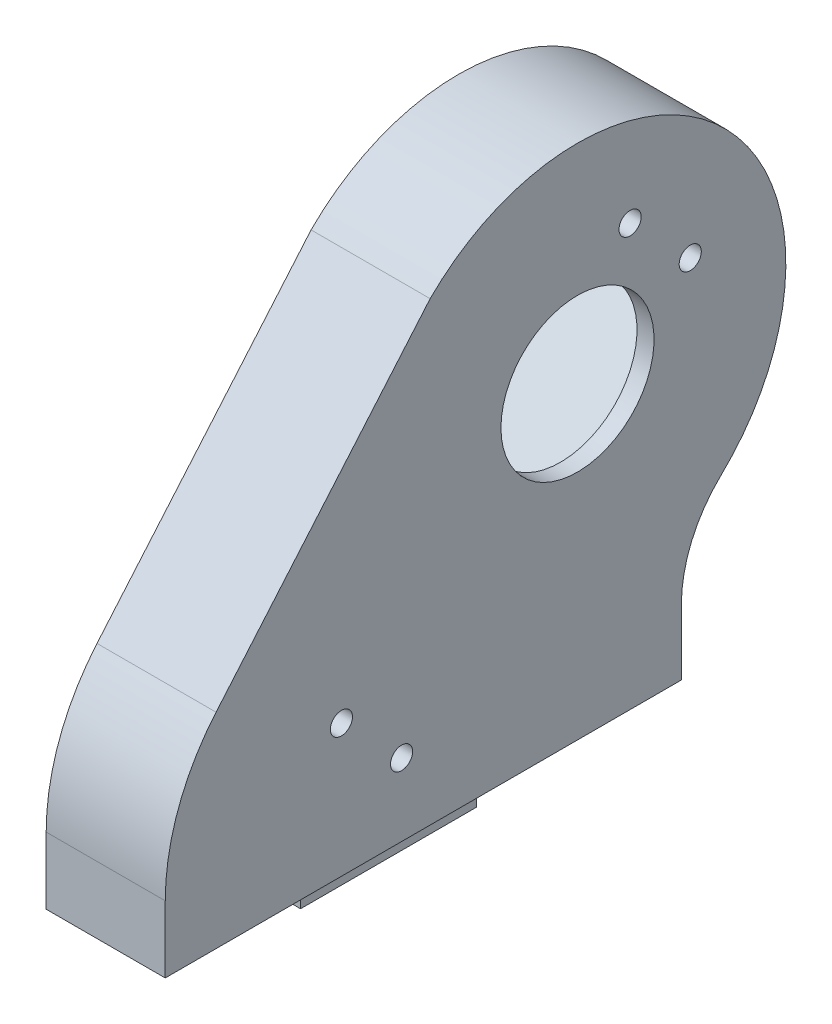
ISO-10303-21;
HEADER;
FILE_DESCRIPTION(('STEP AP214'),'2;1');
FILE_NAME('part.step','',(''),(''),'','','');
FILE_SCHEMA(('AUTOMOTIVE_DESIGN { 1 0 10303 214 1 1 1 1 }'));
ENDSEC;
DATA;
#1=APPLICATION_CONTEXT('core data for automotive mechanical design processes');
#2=APPLICATION_PROTOCOL_DEFINITION('international standard','automotive_design',2000,#1);
#3=PRODUCT_CONTEXT('',#1,'mechanical');
#4=PRODUCT('Part','Part','',(#3));
#5=PRODUCT_RELATED_PRODUCT_CATEGORY('part','',(#4));
#6=PRODUCT_DEFINITION_FORMATION('','',#4);
#7=PRODUCT_DEFINITION_CONTEXT('part definition',#1,'design');
#8=PRODUCT_DEFINITION('design','',#6,#7);
#9=PRODUCT_DEFINITION_SHAPE('','',#8);
#10=(LENGTH_UNIT() NAMED_UNIT(*) SI_UNIT(.MILLI.,.METRE.));
#11=(NAMED_UNIT(*) PLANE_ANGLE_UNIT() SI_UNIT($,.RADIAN.));
#12=(NAMED_UNIT(*) SI_UNIT($,.STERADIAN.) SOLID_ANGLE_UNIT());
#13=UNCERTAINTY_MEASURE_WITH_UNIT(LENGTH_MEASURE(1.E-05),#10,'distance_accuracy_value','');
#14=(GEOMETRIC_REPRESENTATION_CONTEXT(3) GLOBAL_UNCERTAINTY_ASSIGNED_CONTEXT((#13)) GLOBAL_UNIT_ASSIGNED_CONTEXT((#10,
#11,#12)) REPRESENTATION_CONTEXT('',''));
#15=CARTESIAN_POINT('',(0.,0.,0.));
#16=DIRECTION('',(0.,0.,1.));
#17=DIRECTION('',(1.,0.,0.));
#18=AXIS2_PLACEMENT_3D('',#15,#16,#17);
#19=CARTESIAN_POINT('',(1.99999999999999,54.948945885554,-13.741729606692));
#20=DIRECTION('',(0.,0.707106781186547,-0.707106781186548));
#21=DIRECTION('',(0.,0.707106781186548,0.707106781186547));
#22=AXIS2_PLACEMENT_3D('',#19,#20,#21);
#23=PLANE('',#22);
#24=DIRECTION('',(0.,-0.707106781186548,-0.707106781186547));
#25=VECTOR('',#24,1.);
#26=CARTESIAN_POINT('',(-3.5,54.948945885554,-13.741729606692));
#27=LINE('',#26,#25);
#28=CARTESIAN_POINT('',(-3.5,54.948945885554,-13.741729606692));
#29=VERTEX_POINT('',#28);
#30=CARTESIAN_POINT('',(-3.5,40.0997034806365,-28.5909720116095));
#31=VERTEX_POINT('',#30);
#32=EDGE_CURVE('E277',#29,#31,#27,.T.);
#33=ORIENTED_EDGE('',*,*,#32,.T.);
#34=DIRECTION('',(-1.,0.,0.));
#35=VECTOR('',#34,1.);
#36=CARTESIAN_POINT('',(1.99999999999999,40.0997034806365,-28.5909720116095));
#37=LINE('',#36,#35);
#38=CARTESIAN_POINT('',(1.99999999999999,40.0997034806365,-28.5909720116095));
#39=VERTEX_POINT('',#38);
#40=EDGE_CURVE('E389',#39,#31,#37,.T.);
#41=ORIENTED_EDGE('',*,*,#40,.F.);
#42=DIRECTION('',(0.,-0.707106781186548,-0.707106781186547));
#43=VECTOR('',#42,1.);
#44=CARTESIAN_POINT('',(1.99999999999999,54.948945885554,-13.741729606692));
#45=LINE('',#44,#43);
#46=CARTESIAN_POINT('',(1.99999999999999,54.948945885554,-13.741729606692));
#47=VERTEX_POINT('',#46);
#48=EDGE_CURVE('E374',#47,#39,#45,.T.);
#49=ORIENTED_EDGE('',*,*,#48,.F.);
#50=DIRECTION('',(-1.,0.,0.));
#51=VECTOR('',#50,1.);
#52=CARTESIAN_POINT('',(1.99999999999999,54.948945885554,-13.741729606692));
#53=LINE('',#52,#51);
#54=EDGE_CURVE('E392',#47,#29,#53,.T.);
#55=ORIENTED_EDGE('',*,*,#54,.T.);
#56=EDGE_LOOP('',(#33,#41,#49,#55));
#57=FACE_BOUND('',#56,.T.);
#58=ADVANCED_FACE('F58',(#57),#23,.F.);
#59=CARTESIAN_POINT('',(7.99999999999999,4.,0.));
#60=DIRECTION('',(0.,1.,0.));
#61=DIRECTION('',(1.,0.,0.));
#62=AXIS2_PLACEMENT_3D('',#59,#60,#61);
#63=PLANE('',#62);
#64=DIRECTION('',(-1.,0.,0.));
#65=VECTOR('',#64,1.);
#66=CARTESIAN_POINT('',(98.9638448287514,4.,-26.1299478736219));
#67=LINE('',#66,#65);
#68=CARTESIAN_POINT('',(4.,4.,-26.1299478736219));
#69=VERTEX_POINT('',#68);
#70=CARTESIAN_POINT('',(-10.,4.,-26.1299478736219));
#71=VERTEX_POINT('',#70);
#72=EDGE_CURVE('E412',#69,#71,#67,.T.);
#73=ORIENTED_EDGE('',*,*,#72,.F.);
#74=DIRECTION('',(0.,0.,-1.));
#75=VECTOR('',#74,1.);
#76=CARTESIAN_POINT('',(4.,4.,-26.1299478736219));
#77=LINE('',#76,#75);
#78=CARTESIAN_POINT('',(4.,4.,34.549646217337));
#79=VERTEX_POINT('',#78);
#80=EDGE_CURVE('E398',#79,#69,#77,.T.);
#81=ORIENTED_EDGE('',*,*,#80,.F.);
#82=DIRECTION('',(1.,0.,0.));
#83=VECTOR('',#82,1.);
#84=CARTESIAN_POINT('',(-10.,4.,34.5496462173369));
#85=LINE('',#84,#83);
#86=CARTESIAN_POINT('',(-10.,4.,34.549646217337));
#87=VERTEX_POINT('',#86);
#88=EDGE_CURVE('E408',#87,#79,#85,.T.);
#89=ORIENTED_EDGE('',*,*,#88,.F.);
#90=DIRECTION('',(0.,0.,1.));
#91=VECTOR('',#90,1.);
#92=CARTESIAN_POINT('',(-10.,4.,-15.1299478736219));
#93=LINE('',#92,#91);
#94=EDGE_CURVE('E212',#71,#87,#93,.T.);
#95=ORIENTED_EDGE('',*,*,#94,.F.);
#96=EDGE_LOOP('',(#73,#81,#89,#95));
#97=FACE_BOUND('',#96,.T.);
#98=DIRECTION('',(0.,0.,-1.));
#99=VECTOR('',#98,1.);
#100=CARTESIAN_POINT('',(-6.0919121161501,4.,15.549646217337));
#101=LINE('',#100,#99);
#102=CARTESIAN_POINT('',(-6.0919121161501,4.,15.549646217337));
#103=VERTEX_POINT('',#102);
#104=CARTESIAN_POINT('',(-6.0919121161501,4.,-5.15035378266305));
#105=VERTEX_POINT('',#104);
#106=EDGE_CURVE('E330',#103,#105,#101,.T.);
#107=ORIENTED_EDGE('',*,*,#106,.F.);
#108=DIRECTION('',(-1.,0.,0.));
#109=VECTOR('',#108,1.);
#110=CARTESIAN_POINT('',(-6.0919121161501,4.,15.549646217337));
#111=LINE('',#110,#109);
#112=CARTESIAN_POINT('',(0.908087883849897,4.,15.549646217337));
#113=VERTEX_POINT('',#112);
#114=EDGE_CURVE('E335',#113,#103,#111,.T.);
#115=ORIENTED_EDGE('',*,*,#114,.F.);
#116=DIRECTION('',(0.,0.,1.));
#117=VECTOR('',#116,1.);
#118=CARTESIAN_POINT('',(0.908087883849897,4.,15.549646217337));
#119=LINE('',#118,#117);
#120=CARTESIAN_POINT('',(0.908087883849897,4.,-5.15035378266305));
#121=VERTEX_POINT('',#120);
#122=EDGE_CURVE('E349',#121,#113,#119,.T.);
#123=ORIENTED_EDGE('',*,*,#122,.F.);
#124=DIRECTION('',(1.,0.,0.));
#125=VECTOR('',#124,1.);
#126=CARTESIAN_POINT('',(-6.0919121161501,4.,-5.15035378266305));
#127=LINE('',#126,#125);
#128=EDGE_CURVE('E346',#105,#121,#127,.T.);
#129=ORIENTED_EDGE('',*,*,#128,.F.);
#130=EDGE_LOOP('',(#107,#115,#123,#129));
#131=FACE_BOUND('',#130,.T.);
#132=ADVANCED_FACE('F857',(#97,#131),#63,.F.);
#133=CARTESIAN_POINT('',(98.9638448287514,0.,-26.1299478736219));
#134=DIRECTION('',(0.,0.,-1.));
#135=DIRECTION('',(-1.,0.,0.));
#136=AXIS2_PLACEMENT_3D('',#133,#134,#135);
#137=PLANE('',#136);
#138=DIRECTION('',(0.,1.,0.));
#139=VECTOR('',#138,1.);
#140=CARTESIAN_POINT('',(-10.,0.,-26.1299478736219));
#141=LINE('',#140,#139);
#142=CARTESIAN_POINT('',(-10.,11.644549615917,-26.1299478736219));
#143=VERTEX_POINT('',#142);
#144=EDGE_CURVE('E258',#71,#143,#141,.T.);
#145=ORIENTED_EDGE('',*,*,#144,.T.);
#146=DIRECTION('',(1.,0.,0.));
#147=VECTOR('',#146,1.);
#148=CARTESIAN_POINT('',(4.,11.644549615917,-26.1299478736219));
#149=LINE('',#148,#147);
#150=CARTESIAN_POINT('',(4.,11.644549615917,-26.1299478736219));
#151=VERTEX_POINT('',#150);
#152=EDGE_CURVE('E233',#143,#151,#149,.T.);
#153=ORIENTED_EDGE('',*,*,#152,.T.);
#154=DIRECTION('',(0.,1.,0.));
#155=VECTOR('',#154,1.);
#156=CARTESIAN_POINT('',(4.,19.0366427296958,-26.1299478736219));
#157=LINE('',#156,#155);
#158=EDGE_CURVE('E401',#69,#151,#157,.T.);
#159=ORIENTED_EDGE('',*,*,#158,.F.);
#160=ORIENTED_EDGE('',*,*,#72,.T.);
#161=EDGE_LOOP('',(#145,#153,#159,#160));
#162=FACE_BOUND('',#161,.T.);
#163=ADVANCED_FACE('F853',(#162),#137,.T.);
#164=CARTESIAN_POINT('',(98.9638448287514,40.2764801759331,-13.9185063019886));
#165=DIRECTION('',(-1.,0.,0.));
#166=DIRECTION('',(0.,0.,1.));
#167=AXIS2_PLACEMENT_3D('',#164,#165,#166);
#168=CYLINDRICAL_SURFACE('',#167,24.5);
#169=CARTESIAN_POINT('',(-10.,40.2764801759331,-13.9185063019886));
#170=DIRECTION('',(-1.,0.,0.));
#171=DIRECTION('',(0.,0.,1.));
#172=AXIS2_PLACEMENT_3D('',#169,#170,#171);
#173=CIRCLE('',#172,24.5);
#174=CARTESIAN_POINT('',(-10.,22.5174346387079,-30.796489048951));
#175=VERTEX_POINT('',#174);
#176=CARTESIAN_POINT('',(-10.,57.6005963150038,3.40560983708185));
#177=VERTEX_POINT('',#176);
#178=EDGE_CURVE('E250',#175,#177,#173,.F.);
#179=ORIENTED_EDGE('',*,*,#178,.T.);
#180=DIRECTION('',(-1.,0.,0.));
#181=VECTOR('',#180,1.);
#182=CARTESIAN_POINT('',(98.9638448287514,57.6005963150038,3.40560983708185));
#183=LINE('',#182,#181);
#184=CARTESIAN_POINT('',(4.,57.6005963150038,3.40560983708186));
#185=VERTEX_POINT('',#184);
#186=EDGE_CURVE('E236',#185,#177,#183,.T.);
#187=ORIENTED_EDGE('',*,*,#186,.F.);
#188=CARTESIAN_POINT('',(4.,40.2764801759331,-13.9185063019886));
#189=DIRECTION('',(1.,0.,0.));
#190=DIRECTION('',(0.,0.,1.));
#191=AXIS2_PLACEMENT_3D('',#188,#189,#190);
#192=CIRCLE('',#191,24.5000000000001);
#193=CARTESIAN_POINT('',(4.,22.5174346387078,-30.7964890489511));
#194=VERTEX_POINT('',#193);
#195=EDGE_CURVE('E252',#194,#185,#192,.T.);
#196=ORIENTED_EDGE('',*,*,#195,.F.);
#197=DIRECTION('',(-1.,0.,0.));
#198=VECTOR('',#197,1.);
#199=CARTESIAN_POINT('',(98.9638448287514,22.5174346387079,-30.796489048951));
#200=LINE('',#199,#198);
#201=EDGE_CURVE('E223',#194,#175,#200,.T.);
#202=ORIENTED_EDGE('',*,*,#201,.T.);
#203=EDGE_LOOP('',(#179,#187,#196,#202));
#204=FACE_BOUND('',#203,.T.);
#205=ADVANCED_FACE('F248',(#204),#168,.T.);
#206=CARTESIAN_POINT('',(98.9638448287514,25.9248128608695,30.4097431541046));
#207=DIRECTION('',(0.,-0.648759583452649,-0.760993431560579));
#208=DIRECTION('',(0.,-0.760993431560579,0.648759583452649));
#209=AXIS2_PLACEMENT_3D('',#206,#207,#208);
#210=PLANE('',#209);
#211=DIRECTION('',(-1.,0.,0.));
#212=VECTOR('',#211,1.);
#213=CARTESIAN_POINT('',(98.9638448287514,28.0775697746182,28.5744820063514));
#214=LINE('',#213,#212);
#215=CARTESIAN_POINT('',(-10.,28.0775697746182,28.5744820063514));
#216=VERTEX_POINT('',#215);
#217=CARTESIAN_POINT('',(4.,28.0775697746182,28.5744820063514));
#218=VERTEX_POINT('',#217);
#219=EDGE_CURVE('E67',#216,#218,#214,.F.);
#220=ORIENTED_EDGE('',*,*,#219,.T.);
#221=DIRECTION('',(0.,-0.760993431560579,0.648759583452649));
#222=VECTOR('',#221,1.);
#223=CARTESIAN_POINT('',(4.,21.0687165213735,34.549646217337));
#224=LINE('',#223,#222);
#225=EDGE_CURVE('E405',#185,#218,#224,.T.);
#226=ORIENTED_EDGE('',*,*,#225,.F.);
#227=ORIENTED_EDGE('',*,*,#186,.T.);
#228=DIRECTION('',(0.,0.760993431560579,-0.648759583452649));
#229=VECTOR('',#228,1.);
#230=CARTESIAN_POINT('',(-10.,25.9248128608695,30.4097431541046));
#231=LINE('',#230,#229);
#232=EDGE_CURVE('E216',#216,#177,#231,.T.);
#233=ORIENTED_EDGE('',*,*,#232,.F.);
#234=EDGE_LOOP('',(#220,#226,#227,#233));
#235=FACE_BOUND('',#234,.T.);
#236=ADVANCED_FACE('F861',(#235),#210,.F.);
#237=CARTESIAN_POINT('',(-10.,0.,34.5496462173369));
#238=DIRECTION('',(0.,0.,-1.));
#239=DIRECTION('',(-1.,0.,0.));
#240=AXIS2_PLACEMENT_3D('',#237,#238,#239);
#241=PLANE('',#240);
#242=ORIENTED_EDGE('',*,*,#88,.T.);
#243=DIRECTION('',(0.,-1.,0.));
#244=VECTOR('',#243,1.);
#245=CARTESIAN_POINT('',(4.,4.,34.549646217337));
#246=LINE('',#245,#244);
#247=CARTESIAN_POINT('',(4.,11.858580188302,34.549646217337));
#248=VERTEX_POINT('',#247);
#249=EDGE_CURVE('E219',#248,#79,#246,.T.);
#250=ORIENTED_EDGE('',*,*,#249,.F.);
#251=DIRECTION('',(-1.,0.,0.));
#252=VECTOR('',#251,1.);
#253=CARTESIAN_POINT('',(-10.,11.858580188302,34.549646217337));
#254=LINE('',#253,#252);
#255=CARTESIAN_POINT('',(-10.,11.858580188302,34.549646217337));
#256=VERTEX_POINT('',#255);
#257=EDGE_CURVE('E204',#248,#256,#254,.T.);
#258=ORIENTED_EDGE('',*,*,#257,.T.);
#259=DIRECTION('',(0.,1.,0.));
#260=VECTOR('',#259,1.);
#261=CARTESIAN_POINT('',(-10.,0.,34.5496462173369));
#262=LINE('',#261,#260);
#263=EDGE_CURVE('E207',#87,#256,#262,.T.);
#264=ORIENTED_EDGE('',*,*,#263,.F.);
#265=EDGE_LOOP('',(#242,#250,#258,#264));
#266=FACE_BOUND('',#265,.T.);
#267=ADVANCED_FACE('F218',(#266),#241,.F.);
#268=CARTESIAN_POINT('',(4.,40.2764801759331,-13.9185063019886));
#269=DIRECTION('',(-1.,0.,0.));
#270=DIRECTION('',(0.,0.,1.));
#271=AXIS2_PLACEMENT_3D('',#268,#269,#270);
#272=PLANE('',#271);
#273=CARTESIAN_POINT('',(4.,19.5936068262266,13.8354348595834));
#274=DIRECTION('',(1.,0.,0.));
#275=DIRECTION('',(0.,0.,-1.));
#276=AXIS2_PLACEMENT_3D('',#273,#274,#275);
#277=CIRCLE('',#276,1.29999999999999);
#278=CARTESIAN_POINT('',(4.,19.5936068262266,12.5354348595834));
#279=VERTEX_POINT('',#278);
#280=EDGE_CURVE('E267',#279,#279,#277,.T.);
#281=ORIENTED_EDGE('',*,*,#280,.F.);
#282=EDGE_LOOP('',(#281));
#283=FACE_BOUND('',#282,.T.);
#284=CARTESIAN_POINT('',(4.,12.5225390143611,6.76436704771787));
#285=DIRECTION('',(1.,0.,0.));
#286=DIRECTION('',(0.,0.,-1.));
#287=AXIS2_PLACEMENT_3D('',#284,#285,#286);
#288=CIRCLE('',#287,1.29999999999999);
#289=CARTESIAN_POINT('',(4.,12.5225390143611,5.46436704771788));
#290=VERTEX_POINT('',#289);
#291=EDGE_CURVE('E273',#290,#290,#288,.T.);
#292=ORIENTED_EDGE('',*,*,#291,.F.);
#293=EDGE_LOOP('',(#292));
#294=FACE_BOUND('',#293,.T.);
#295=CARTESIAN_POINT('',(4.,53.5347323231809,-20.1056906373709));
#296=DIRECTION('',(1.,0.,0.));
#297=DIRECTION('',(0.,0.,-1.));
#298=AXIS2_PLACEMENT_3D('',#295,#296,#297);
#299=CIRCLE('',#298,1.29999999999999);
#300=CARTESIAN_POINT('',(4.,53.5347323231809,-21.4056906373709));
#301=VERTEX_POINT('',#300);
#302=EDGE_CURVE('E270',#301,#301,#299,.T.);
#303=ORIENTED_EDGE('',*,*,#302,.F.);
#304=EDGE_LOOP('',(#303));
#305=FACE_BOUND('',#304,.T.);
#306=CARTESIAN_POINT('',(4.,46.4636645113155,-27.1767584492364));
#307=DIRECTION('',(1.,0.,0.));
#308=DIRECTION('',(0.,0.,-1.));
#309=AXIS2_PLACEMENT_3D('',#306,#307,#308);
#310=CIRCLE('',#309,1.29999999999999);
#311=CARTESIAN_POINT('',(4.,46.4636645113155,-28.4767584492364));
#312=VERTEX_POINT('',#311);
#313=EDGE_CURVE('E264',#312,#312,#310,.T.);
#314=ORIENTED_EDGE('',*,*,#313,.F.);
#315=EDGE_LOOP('',(#314));
#316=FACE_BOUND('',#315,.T.);
#317=CARTESIAN_POINT('',(4.,40.2764801759331,-13.9185063019886));
#318=DIRECTION('',(-1.,0.,0.));
#319=DIRECTION('',(0.,0.,1.));
#320=AXIS2_PLACEMENT_3D('',#317,#318,#319);
#321=CIRCLE('',#320,8.99999999999999);
#322=CARTESIAN_POINT('',(4.,40.2764801759331,-4.91850630198863));
#323=VERTEX_POINT('',#322);
#324=EDGE_CURVE('E364',#323,#323,#321,.T.);
#325=ORIENTED_EDGE('',*,*,#324,.T.);
#326=EDGE_LOOP('',(#325));
#327=FACE_BOUND('',#326,.T.);
#328=ORIENTED_EDGE('',*,*,#225,.T.);
#329=CARTESIAN_POINT('',(4.,11.858580188302,9.54964621733696));
#330=DIRECTION('',(-1.,0.,0.));
#331=DIRECTION('',(0.,0.,1.));
#332=AXIS2_PLACEMENT_3D('',#329,#330,#331);
#333=CIRCLE('',#332,25.);
#334=EDGE_CURVE('E13',#218,#248,#333,.F.);
#335=ORIENTED_EDGE('',*,*,#334,.T.);
#336=ORIENTED_EDGE('',*,*,#249,.T.);
#337=ORIENTED_EDGE('',*,*,#80,.T.);
#338=ORIENTED_EDGE('',*,*,#158,.T.);
#339=CARTESIAN_POINT('',(4.,11.644549615917,-41.1299478736219));
#340=DIRECTION('',(-1.,0.,0.));
#341=DIRECTION('',(0.,0.,1.));
#342=AXIS2_PLACEMENT_3D('',#339,#340,#341);
#343=CIRCLE('',#342,15.);
#344=EDGE_CURVE('E220',#151,#194,#343,.T.);
#345=ORIENTED_EDGE('',*,*,#344,.T.);
#346=ORIENTED_EDGE('',*,*,#195,.T.);
#347=EDGE_LOOP('',(#328,#335,#336,#337,#338,#345,#346));
#348=FACE_BOUND('',#347,.T.);
#349=ADVANCED_FACE('F868',(#283,#294,#305,#316,#327,#348),#272,.F.);
#350=CARTESIAN_POINT('',(-10.,24.7119793601216,22.6009444067097));
#351=DIRECTION('',(-1.,0.,0.));
#352=DIRECTION('',(0.,0.,1.));
#353=AXIS2_PLACEMENT_3D('',#350,#351,#352);
#354=PLANE('',#353);
#355=DIRECTION('',(0.,0.707106781186548,-0.707106781186548));
#356=VECTOR('',#355,1.);
#357=CARTESIAN_POINT('',(-10.,25.9575678569056,15.2496484219565));
#358=LINE('',#357,#356);
#359=CARTESIAN_POINT('',(-10.,25.9575678569056,15.2496484219565));
#360=VERTEX_POINT('',#359);
#361=CARTESIAN_POINT('',(-10.,59.0360747026256,-17.8288584237636));
#362=VERTEX_POINT('',#361);
#363=EDGE_CURVE('E382',#360,#362,#358,.T.);
#364=ORIENTED_EDGE('',*,*,#363,.F.);
#365=DIRECTION('',(0.,0.707106781186548,0.707106781186547));
#366=VECTOR('',#365,1.);
#367=CARTESIAN_POINT('',(-10.,11.108325451988,0.400406017038955));
#368=LINE('',#367,#366);
#369=CARTESIAN_POINT('',(-10.,11.108325451988,0.400406017038955));
#370=VERTEX_POINT('',#369);
#371=EDGE_CURVE('E367',#370,#360,#368,.T.);
#372=ORIENTED_EDGE('',*,*,#371,.F.);
#373=DIRECTION('',(0.,-0.707106781186547,0.707106781186547));
#374=VECTOR('',#373,1.);
#375=CARTESIAN_POINT('',(-10.,40.0997034806365,-28.5909720116095));
#376=LINE('',#375,#374);
#377=CARTESIAN_POINT('',(-10.,44.1868322977081,-32.6781008286811));
#378=VERTEX_POINT('',#377);
#379=EDGE_CURVE('E372',#378,#370,#376,.T.);
#380=ORIENTED_EDGE('',*,*,#379,.F.);
#381=DIRECTION('',(0.,0.707106781186546,0.707106781186549));
#382=VECTOR('',#381,1.);
#383=CARTESIAN_POINT('',(-10.,59.0360747026256,-17.8288584237636));
#384=LINE('',#383,#382);
#385=EDGE_CURVE('E281',#378,#362,#384,.T.);
#386=ORIENTED_EDGE('',*,*,#385,.T.);
#387=EDGE_LOOP('',(#364,#372,#380,#386));
#388=FACE_BOUND('',#387,.T.);
#389=DIRECTION('',(0.,-0.707106781186547,-0.707106781186547));
#390=VECTOR('',#389,1.);
#391=CARTESIAN_POINT('',(-10.,21.8025485079064,19.2773186975336));
#392=LINE('',#391,#390);
#393=CARTESIAN_POINT('',(-10.,21.8025485079064,19.2773186975336));
#394=VERTEX_POINT('',#393);
#395=CARTESIAN_POINT('',(-10.,6.95330610298891,4.42807629261605));
#396=VERTEX_POINT('',#395);
#397=EDGE_CURVE('E291',#394,#396,#392,.T.);
#398=ORIENTED_EDGE('',*,*,#397,.T.);
#399=DIRECTION('',(0.,0.707106781186547,-0.707106781186547));
#400=VECTOR('',#399,1.);
#401=CARTESIAN_POINT('',(-10.,6.9533061029889,4.42807629261605));
#402=LINE('',#401,#400);
#403=CARTESIAN_POINT('',(-10.,11.0404349200605,0.340947475544445));
#404=VERTEX_POINT('',#403);
#405=EDGE_CURVE('E310',#396,#404,#402,.T.);
#406=ORIENTED_EDGE('',*,*,#405,.T.);
#407=DIRECTION('',(0.,0.707106781186547,0.707106781186547));
#408=VECTOR('',#407,1.);
#409=CARTESIAN_POINT('',(-10.,25.889677324978,15.190189880462));
#410=LINE('',#409,#408);
#411=CARTESIAN_POINT('',(-10.,25.889677324978,15.190189880462));
#412=VERTEX_POINT('',#411);
#413=EDGE_CURVE('E306',#404,#412,#410,.T.);
#414=ORIENTED_EDGE('',*,*,#413,.T.);
#415=DIRECTION('',(0.,-0.707106781186547,0.707106781186547));
#416=VECTOR('',#415,1.);
#417=CARTESIAN_POINT('',(-10.,21.8025485079064,19.2773186975336));
#418=LINE('',#417,#416);
#419=EDGE_CURVE('E303',#412,#394,#418,.T.);
#420=ORIENTED_EDGE('',*,*,#419,.T.);
#421=EDGE_LOOP('',(#398,#406,#414,#420));
#422=FACE_BOUND('',#421,.T.);
#423=ORIENTED_EDGE('',*,*,#263,.T.);
#424=CARTESIAN_POINT('',(-10.,11.858580188302,9.54964621733696));
#425=DIRECTION('',(-1.,0.,0.));
#426=DIRECTION('',(0.,0.,1.));
#427=AXIS2_PLACEMENT_3D('',#424,#425,#426);
#428=CIRCLE('',#427,25.);
#429=EDGE_CURVE('E75',#216,#256,#428,.F.);
#430=ORIENTED_EDGE('',*,*,#429,.F.);
#431=ORIENTED_EDGE('',*,*,#232,.T.);
#432=ORIENTED_EDGE('',*,*,#178,.F.);
#433=CARTESIAN_POINT('',(-10.,11.644549615917,-41.1299478736219));
#434=DIRECTION('',(-1.,0.,0.));
#435=DIRECTION('',(0.,0.,1.));
#436=AXIS2_PLACEMENT_3D('',#433,#434,#435);
#437=CIRCLE('',#436,15.);
#438=EDGE_CURVE('E254',#175,#143,#437,.F.);
#439=ORIENTED_EDGE('',*,*,#438,.T.);
#440=ORIENTED_EDGE('',*,*,#144,.F.);
#441=ORIENTED_EDGE('',*,*,#94,.T.);
#442=EDGE_LOOP('',(#423,#430,#431,#432,#439,#440,#441));
#443=FACE_BOUND('',#442,.T.);
#444=ADVANCED_FACE('F210',(#388,#422,#443),#354,.T.);
#445=CARTESIAN_POINT('',(1.99999999999999,11.108325451988,0.400406017038955));
#446=DIRECTION('',(0.,-0.707106781186547,0.707106781186548));
#447=DIRECTION('',(0.,-0.707106781186548,-0.707106781186547));
#448=AXIS2_PLACEMENT_3D('',#445,#446,#447);
#449=PLANE('',#448);
#450=ORIENTED_EDGE('',*,*,#371,.T.);
#451=DIRECTION('',(-1.,0.,0.));
#452=VECTOR('',#451,1.);
#453=CARTESIAN_POINT('',(1.99999999999999,25.9575678569056,15.2496484219565));
#454=LINE('',#453,#452);
#455=CARTESIAN_POINT('',(1.99999999999999,25.9575678569056,15.2496484219565));
#456=VERTEX_POINT('',#455);
#457=EDGE_CURVE('E379',#456,#360,#454,.T.);
#458=ORIENTED_EDGE('',*,*,#457,.F.);
#459=DIRECTION('',(0.,0.707106781186548,0.707106781186547));
#460=VECTOR('',#459,1.);
#461=CARTESIAN_POINT('',(1.99999999999999,11.108325451988,0.400406017038955));
#462=LINE('',#461,#460);
#463=CARTESIAN_POINT('',(1.99999999999999,11.108325451988,0.400406017038955));
#464=VERTEX_POINT('',#463);
#465=EDGE_CURVE('E368',#464,#456,#462,.T.);
#466=ORIENTED_EDGE('',*,*,#465,.F.);
#467=DIRECTION('',(-1.,0.,0.));
#468=VECTOR('',#467,1.);
#469=CARTESIAN_POINT('',(1.99999999999999,11.108325451988,0.400406017038955));
#470=LINE('',#469,#468);
#471=EDGE_CURVE('E387',#464,#370,#470,.T.);
#472=ORIENTED_EDGE('',*,*,#471,.T.);
#473=EDGE_LOOP('',(#450,#458,#466,#472));
#474=FACE_BOUND('',#473,.T.);
#475=ADVANCED_FACE('F877',(#474),#449,.F.);
#476=CARTESIAN_POINT('',(1.99999999999999,40.0997034806365,-28.5909720116095));
#477=DIRECTION('',(0.,-0.707106781186548,-0.707106781186548));
#478=DIRECTION('',(0.,0.707106781186548,-0.707106781186548));
#479=AXIS2_PLACEMENT_3D('',#476,#477,#478);
#480=PLANE('',#479);
#481=ORIENTED_EDGE('',*,*,#379,.T.);
#482=ORIENTED_EDGE('',*,*,#471,.F.);
#483=DIRECTION('',(0.,-0.707106781186547,0.707106781186547));
#484=VECTOR('',#483,1.);
#485=CARTESIAN_POINT('',(1.99999999999999,40.0997034806365,-28.5909720116095));
#486=LINE('',#485,#484);
#487=EDGE_CURVE('E377',#39,#464,#486,.T.);
#488=ORIENTED_EDGE('',*,*,#487,.F.);
#489=ORIENTED_EDGE('',*,*,#40,.T.);
#490=DIRECTION('',(0.,0.707106781186549,-0.707106781186546));
#491=VECTOR('',#490,1.);
#492=CARTESIAN_POINT('',(-3.5,40.0997034806365,-28.5909720116095));
#493=LINE('',#492,#491);
#494=CARTESIAN_POINT('',(-3.5,44.1868322977081,-32.6781008286811));
#495=VERTEX_POINT('',#494);
#496=EDGE_CURVE('E280',#31,#495,#493,.T.);
#497=ORIENTED_EDGE('',*,*,#496,.T.);
#498=DIRECTION('',(-1.,0.,0.));
#499=VECTOR('',#498,1.);
#500=CARTESIAN_POINT('',(-3.5,44.1868322977081,-32.6781008286811));
#501=LINE('',#500,#499);
#502=EDGE_CURVE('E288',#495,#378,#501,.T.);
#503=ORIENTED_EDGE('',*,*,#502,.T.);
#504=EDGE_LOOP('',(#481,#482,#488,#489,#497,#503));
#505=FACE_BOUND('',#504,.T.);
#506=ADVANCED_FACE('F881',(#505),#480,.F.);
#507=CARTESIAN_POINT('',(1.99999999999999,25.9575678569056,15.2496484219565));
#508=DIRECTION('',(0.,0.707106781186547,0.707106781186548));
#509=DIRECTION('',(0.,-0.707106781186548,0.707106781186547));
#510=AXIS2_PLACEMENT_3D('',#507,#508,#509);
#511=PLANE('',#510);
#512=ORIENTED_EDGE('',*,*,#363,.T.);
#513=DIRECTION('',(-1.,0.,0.));
#514=VECTOR('',#513,1.);
#515=CARTESIAN_POINT('',(-3.5,59.0360747026256,-17.8288584237636));
#516=LINE('',#515,#514);
#517=CARTESIAN_POINT('',(-3.5,59.0360747026256,-17.8288584237636));
#518=VERTEX_POINT('',#517);
#519=EDGE_CURVE('E292',#518,#362,#516,.T.);
#520=ORIENTED_EDGE('',*,*,#519,.F.);
#521=DIRECTION('',(0.,-0.707106781186549,0.707106781186546));
#522=VECTOR('',#521,1.);
#523=CARTESIAN_POINT('',(-3.5,54.948945885554,-13.741729606692));
#524=LINE('',#523,#522);
#525=EDGE_CURVE('E286',#518,#29,#524,.T.);
#526=ORIENTED_EDGE('',*,*,#525,.T.);
#527=ORIENTED_EDGE('',*,*,#54,.F.);
#528=DIRECTION('',(0.,0.707106781186548,-0.707106781186548));
#529=VECTOR('',#528,1.);
#530=CARTESIAN_POINT('',(1.99999999999999,25.9575678569056,15.2496484219565));
#531=LINE('',#530,#529);
#532=EDGE_CURVE('E371',#456,#47,#531,.T.);
#533=ORIENTED_EDGE('',*,*,#532,.F.);
#534=ORIENTED_EDGE('',*,*,#457,.T.);
#535=EDGE_LOOP('',(#512,#520,#526,#527,#533,#534));
#536=FACE_BOUND('',#535,.T.);
#537=ADVANCED_FACE('F883',(#536),#511,.F.);
#538=CARTESIAN_POINT('',(1.99999999999999,0.,0.));
#539=DIRECTION('',(-1.,0.,0.));
#540=DIRECTION('',(0.,0.,1.));
#541=AXIS2_PLACEMENT_3D('',#538,#539,#540);
#542=PLANE('',#541);
#543=CARTESIAN_POINT('',(1.99999999999999,40.2764801759331,-13.9185063019886));
#544=DIRECTION('',(-1.,0.,0.));
#545=DIRECTION('',(0.,0.,1.));
#546=AXIS2_PLACEMENT_3D('',#543,#544,#545);
#547=CIRCLE('',#546,8.99999999999999);
#548=CARTESIAN_POINT('',(1.99999999999999,40.2764801759331,-4.91850630198863));
#549=VERTEX_POINT('',#548);
#550=EDGE_CURVE('E361',#549,#549,#547,.T.);
#551=ORIENTED_EDGE('',*,*,#550,.F.);
#552=EDGE_LOOP('',(#551));
#553=FACE_BOUND('',#552,.T.);
#554=ORIENTED_EDGE('',*,*,#465,.T.);
#555=ORIENTED_EDGE('',*,*,#532,.T.);
#556=ORIENTED_EDGE('',*,*,#48,.T.);
#557=ORIENTED_EDGE('',*,*,#487,.T.);
#558=EDGE_LOOP('',(#554,#555,#556,#557));
#559=FACE_BOUND('',#558,.T.);
#560=ADVANCED_FACE('F886',(#553,#559),#542,.T.);
#561=CARTESIAN_POINT('',(1.99999999999999,40.2764801759331,-13.9185063019886));
#562=DIRECTION('',(-1.,0.,0.));
#563=DIRECTION('',(0.,0.,1.));
#564=AXIS2_PLACEMENT_3D('',#561,#562,#563);
#565=CYLINDRICAL_SURFACE('',#564,8.99999999999999);
#566=ORIENTED_EDGE('',*,*,#550,.T.);
#567=EDGE_LOOP('',(#566));
#568=FACE_BOUND('',#567,.T.);
#569=ORIENTED_EDGE('',*,*,#324,.F.);
#570=EDGE_LOOP('',(#569));
#571=FACE_BOUND('',#570,.T.);
#572=ADVANCED_FACE('F896',(#568,#571),#565,.F.);
#573=CARTESIAN_POINT('',(98.9638448287514,11.644549615917,-41.1299478736219));
#574=DIRECTION('',(-1.,0.,0.));
#575=DIRECTION('',(0.,0.,1.));
#576=AXIS2_PLACEMENT_3D('',#573,#574,#575);
#577=CYLINDRICAL_SURFACE('',#576,15.);
#578=ORIENTED_EDGE('',*,*,#201,.F.);
#579=ORIENTED_EDGE('',*,*,#344,.F.);
#580=ORIENTED_EDGE('',*,*,#152,.F.);
#581=ORIENTED_EDGE('',*,*,#438,.F.);
#582=EDGE_LOOP('',(#578,#579,#580,#581));
#583=FACE_BOUND('',#582,.T.);
#584=ADVANCED_FACE('F512',(#583),#577,.F.);
#585=CARTESIAN_POINT('',(-10.,11.858580188302,9.54964621733696));
#586=DIRECTION('',(-1.,0.,0.));
#587=DIRECTION('',(0.,0.,1.));
#588=AXIS2_PLACEMENT_3D('',#585,#586,#587);
#589=CYLINDRICAL_SURFACE('',#588,25.);
#590=ORIENTED_EDGE('',*,*,#429,.T.);
#591=ORIENTED_EDGE('',*,*,#257,.F.);
#592=ORIENTED_EDGE('',*,*,#334,.F.);
#593=ORIENTED_EDGE('',*,*,#219,.F.);
#594=EDGE_LOOP('',(#590,#591,#592,#593));
#595=FACE_BOUND('',#594,.T.);
#596=ADVANCED_FACE('F60',(#595),#589,.T.);
#597=CARTESIAN_POINT('',(-6.0919121161501,0.,15.549646217337));
#598=DIRECTION('',(1.,0.,0.));
#599=DIRECTION('',(0.,0.,-1.));
#600=AXIS2_PLACEMENT_3D('',#597,#598,#599);
#601=PLANE('',#600);
#602=ORIENTED_EDGE('',*,*,#106,.T.);
#603=DIRECTION('',(0.,1.,0.));
#604=VECTOR('',#603,1.);
#605=CARTESIAN_POINT('',(-6.0919121161501,0.,-5.15035378266305));
#606=LINE('',#605,#604);
#607=CARTESIAN_POINT('',(-6.0919121161501,0.,-5.15035378266305));
#608=VERTEX_POINT('',#607);
#609=EDGE_CURVE('E359',#608,#105,#606,.T.);
#610=ORIENTED_EDGE('',*,*,#609,.F.);
#611=DIRECTION('',(0.,0.,-1.));
#612=VECTOR('',#611,1.);
#613=CARTESIAN_POINT('',(-6.0919121161501,0.,15.549646217337));
#614=LINE('',#613,#612);
#615=CARTESIAN_POINT('',(-6.0919121161501,0.,15.549646217337));
#616=VERTEX_POINT('',#615);
#617=EDGE_CURVE('E331',#616,#608,#614,.T.);
#618=ORIENTED_EDGE('',*,*,#617,.F.);
#619=DIRECTION('',(0.,1.,0.));
#620=VECTOR('',#619,1.);
#621=CARTESIAN_POINT('',(-6.0919121161501,0.,15.549646217337));
#622=LINE('',#621,#620);
#623=EDGE_CURVE('E343',#616,#103,#622,.T.);
#624=ORIENTED_EDGE('',*,*,#623,.T.);
#625=EDGE_LOOP('',(#602,#610,#618,#624));
#626=FACE_BOUND('',#625,.T.);
#627=ADVANCED_FACE('F920',(#626),#601,.F.);
#628=CARTESIAN_POINT('',(-6.0919121161501,0.,-5.15035378266305));
#629=DIRECTION('',(0.,0.,1.));
#630=DIRECTION('',(1.,0.,0.));
#631=AXIS2_PLACEMENT_3D('',#628,#629,#630);
#632=PLANE('',#631);
#633=ORIENTED_EDGE('',*,*,#128,.T.);
#634=DIRECTION('',(0.,1.,0.));
#635=VECTOR('',#634,1.);
#636=CARTESIAN_POINT('',(0.908087883849897,0.,-5.15035378266305));
#637=LINE('',#636,#635);
#638=CARTESIAN_POINT('',(0.908087883849897,0.,-5.15035378266305));
#639=VERTEX_POINT('',#638);
#640=EDGE_CURVE('E357',#639,#121,#637,.T.);
#641=ORIENTED_EDGE('',*,*,#640,.F.);
#642=DIRECTION('',(1.,0.,0.));
#643=VECTOR('',#642,1.);
#644=CARTESIAN_POINT('',(-6.0919121161501,0.,-5.15035378266305));
#645=LINE('',#644,#643);
#646=EDGE_CURVE('E334',#608,#639,#645,.T.);
#647=ORIENTED_EDGE('',*,*,#646,.F.);
#648=ORIENTED_EDGE('',*,*,#609,.T.);
#649=EDGE_LOOP('',(#633,#641,#647,#648));
#650=FACE_BOUND('',#649,.T.);
#651=ADVANCED_FACE('F923',(#650),#632,.F.);
#652=CARTESIAN_POINT('',(0.908087883849897,0.,15.549646217337));
#653=DIRECTION('',(-1.,0.,0.));
#654=DIRECTION('',(0.,0.,1.));
#655=AXIS2_PLACEMENT_3D('',#652,#653,#654);
#656=PLANE('',#655);
#657=ORIENTED_EDGE('',*,*,#122,.T.);
#658=DIRECTION('',(0.,1.,0.));
#659=VECTOR('',#658,1.);
#660=CARTESIAN_POINT('',(0.908087883849897,0.,15.549646217337));
#661=LINE('',#660,#659);
#662=CARTESIAN_POINT('',(0.908087883849897,0.,15.549646217337));
#663=VERTEX_POINT('',#662);
#664=EDGE_CURVE('E355',#663,#113,#661,.T.);
#665=ORIENTED_EDGE('',*,*,#664,.F.);
#666=DIRECTION('',(0.,0.,1.));
#667=VECTOR('',#666,1.);
#668=CARTESIAN_POINT('',(0.908087883849897,0.,15.549646217337));
#669=LINE('',#668,#667);
#670=EDGE_CURVE('E338',#639,#663,#669,.T.);
#671=ORIENTED_EDGE('',*,*,#670,.F.);
#672=ORIENTED_EDGE('',*,*,#640,.T.);
#673=EDGE_LOOP('',(#657,#665,#671,#672));
#674=FACE_BOUND('',#673,.T.);
#675=ADVANCED_FACE('F927',(#674),#656,.F.);
#676=CARTESIAN_POINT('',(-6.0919121161501,0.,15.549646217337));
#677=DIRECTION('',(0.,0.,-1.));
#678=DIRECTION('',(-1.,0.,0.));
#679=AXIS2_PLACEMENT_3D('',#676,#677,#678);
#680=PLANE('',#679);
#681=ORIENTED_EDGE('',*,*,#114,.T.);
#682=ORIENTED_EDGE('',*,*,#623,.F.);
#683=DIRECTION('',(-1.,0.,0.));
#684=VECTOR('',#683,1.);
#685=CARTESIAN_POINT('',(-6.0919121161501,0.,15.549646217337));
#686=LINE('',#685,#684);
#687=EDGE_CURVE('E341',#663,#616,#686,.T.);
#688=ORIENTED_EDGE('',*,*,#687,.F.);
#689=ORIENTED_EDGE('',*,*,#664,.T.);
#690=EDGE_LOOP('',(#681,#682,#688,#689));
#691=FACE_BOUND('',#690,.T.);
#692=ADVANCED_FACE('F931',(#691),#680,.F.);
#693=CARTESIAN_POINT('',(7.99999999999999,0.,0.));
#694=DIRECTION('',(0.,-1.,0.));
#695=DIRECTION('',(0.,0.,-1.));
#696=AXIS2_PLACEMENT_3D('',#693,#694,#695);
#697=PLANE('',#696);
#698=ORIENTED_EDGE('',*,*,#617,.T.);
#699=ORIENTED_EDGE('',*,*,#646,.T.);
#700=ORIENTED_EDGE('',*,*,#670,.T.);
#701=ORIENTED_EDGE('',*,*,#687,.T.);
#702=EDGE_LOOP('',(#698,#699,#700,#701));
#703=FACE_BOUND('',#702,.T.);
#704=ADVANCED_FACE('F935',(#703),#697,.T.);
#705=CARTESIAN_POINT('',(-3.5,0.,0.));
#706=DIRECTION('',(-1.,0.,0.));
#707=DIRECTION('',(0.,0.,-1.));
#708=AXIS2_PLACEMENT_3D('',#705,#706,#707);
#709=PLANE('',#708);
#710=DIRECTION('',(0.,-0.707106781186547,-0.707106781186547));
#711=VECTOR('',#710,1.);
#712=CARTESIAN_POINT('',(-3.5,21.8025485079064,19.2773186975336));
#713=LINE('',#712,#711);
#714=CARTESIAN_POINT('',(-3.5,21.8025485079064,19.2773186975336));
#715=VERTEX_POINT('',#714);
#716=CARTESIAN_POINT('',(-3.5,6.9533061029889,4.42807629261605));
#717=VERTEX_POINT('',#716);
#718=EDGE_CURVE('E307',#715,#717,#713,.T.);
#719=ORIENTED_EDGE('',*,*,#718,.F.);
#720=DIRECTION('',(0.,-0.707106781186547,0.707106781186547));
#721=VECTOR('',#720,1.);
#722=CARTESIAN_POINT('',(-3.5,21.8025485079064,19.2773186975336));
#723=LINE('',#722,#721);
#724=CARTESIAN_POINT('',(-3.5,25.889677324978,15.190189880462));
#725=VERTEX_POINT('',#724);
#726=EDGE_CURVE('E297',#725,#715,#723,.T.);
#727=ORIENTED_EDGE('',*,*,#726,.F.);
#728=DIRECTION('',(0.,0.707106781186547,0.707106781186547));
#729=VECTOR('',#728,1.);
#730=CARTESIAN_POINT('',(-3.5,25.889677324978,15.190189880462));
#731=LINE('',#730,#729);
#732=CARTESIAN_POINT('',(-3.5,11.0404349200605,0.340947475544445));
#733=VERTEX_POINT('',#732);
#734=EDGE_CURVE('E317',#733,#725,#731,.T.);
#735=ORIENTED_EDGE('',*,*,#734,.F.);
#736=DIRECTION('',(0.,0.707106781186547,-0.707106781186547));
#737=VECTOR('',#736,1.);
#738=CARTESIAN_POINT('',(-3.5,6.9533061029889,4.42807629261605));
#739=LINE('',#738,#737);
#740=EDGE_CURVE('E320',#717,#733,#739,.T.);
#741=ORIENTED_EDGE('',*,*,#740,.F.);
#742=EDGE_LOOP('',(#719,#727,#735,#741));
#743=FACE_BOUND('',#742,.T.);
#744=CARTESIAN_POINT('',(-3.5,19.5936068262266,13.8354348595834));
#745=DIRECTION('',(1.,0.,0.));
#746=DIRECTION('',(0.,0.,-1.));
#747=AXIS2_PLACEMENT_3D('',#744,#745,#746);
#748=CIRCLE('',#747,1.29999999999999);
#749=CARTESIAN_POINT('',(-3.5,19.5936068262266,12.5354348595834));
#750=VERTEX_POINT('',#749);
#751=EDGE_CURVE('E294',#750,#750,#748,.F.);
#752=ORIENTED_EDGE('',*,*,#751,.F.);
#753=EDGE_LOOP('',(#752));
#754=FACE_BOUND('',#753,.T.);
#755=CARTESIAN_POINT('',(-3.5,12.5225390143611,6.76436704771787));
#756=DIRECTION('',(1.,0.,0.));
#757=DIRECTION('',(0.,0.,-1.));
#758=AXIS2_PLACEMENT_3D('',#755,#756,#757);
#759=CIRCLE('',#758,1.29999999999999);
#760=CARTESIAN_POINT('',(-3.5,12.5225390143611,5.46436704771788));
#761=VERTEX_POINT('',#760);
#762=EDGE_CURVE('E324',#761,#761,#759,.F.);
#763=ORIENTED_EDGE('',*,*,#762,.F.);
#764=EDGE_LOOP('',(#763));
#765=FACE_BOUND('',#764,.T.);
#766=ADVANCED_FACE('F939',(#743,#754,#765),#709,.T.);
#767=CARTESIAN_POINT('',(-3.5,21.8025485079064,19.2773186975336));
#768=DIRECTION('',(0.,-0.707106781186548,0.707106781186548));
#769=DIRECTION('',(0.,-0.707106781186548,-0.707106781186548));
#770=AXIS2_PLACEMENT_3D('',#767,#768,#769);
#771=PLANE('',#770);
#772=ORIENTED_EDGE('',*,*,#397,.F.);
#773=DIRECTION('',(-1.,0.,0.));
#774=VECTOR('',#773,1.);
#775=CARTESIAN_POINT('',(-3.5,21.8025485079064,19.2773186975336));
#776=LINE('',#775,#774);
#777=EDGE_CURVE('E276',#715,#394,#776,.T.);
#778=ORIENTED_EDGE('',*,*,#777,.F.);
#779=ORIENTED_EDGE('',*,*,#718,.T.);
#780=DIRECTION('',(-1.,0.,0.));
#781=VECTOR('',#780,1.);
#782=CARTESIAN_POINT('',(-3.5,6.9533061029889,4.42807629261605));
#783=LINE('',#782,#781);
#784=EDGE_CURVE('E83',#717,#396,#783,.T.);
#785=ORIENTED_EDGE('',*,*,#784,.T.);
#786=EDGE_LOOP('',(#772,#778,#779,#785));
#787=FACE_BOUND('',#786,.T.);
#788=ADVANCED_FACE('F943',(#787),#771,.F.);
#789=CARTESIAN_POINT('',(-3.5,21.8025485079064,19.2773186975336));
#790=DIRECTION('',(0.,0.707106781186548,0.707106781186548));
#791=DIRECTION('',(0.,-0.707106781186548,0.707106781186548));
#792=AXIS2_PLACEMENT_3D('',#789,#790,#791);
#793=PLANE('',#792);
#794=ORIENTED_EDGE('',*,*,#419,.F.);
#795=DIRECTION('',(-1.,0.,0.));
#796=VECTOR('',#795,1.);
#797=CARTESIAN_POINT('',(-3.5,25.889677324978,15.190189880462));
#798=LINE('',#797,#796);
#799=EDGE_CURVE('E300',#725,#412,#798,.T.);
#800=ORIENTED_EDGE('',*,*,#799,.F.);
#801=ORIENTED_EDGE('',*,*,#726,.T.);
#802=ORIENTED_EDGE('',*,*,#777,.T.);
#803=EDGE_LOOP('',(#794,#800,#801,#802));
#804=FACE_BOUND('',#803,.T.);
#805=ADVANCED_FACE('F945',(#804),#793,.F.);
#806=CARTESIAN_POINT('',(-3.5,25.889677324978,15.190189880462));
#807=DIRECTION('',(0.,0.707106781186548,-0.707106781186548));
#808=DIRECTION('',(0.,0.707106781186548,0.707106781186548));
#809=AXIS2_PLACEMENT_3D('',#806,#807,#808);
#810=PLANE('',#809);
#811=ORIENTED_EDGE('',*,*,#413,.F.);
#812=DIRECTION('',(-1.,0.,0.));
#813=VECTOR('',#812,1.);
#814=CARTESIAN_POINT('',(-3.5,11.0404349200605,0.340947475544445));
#815=LINE('',#814,#813);
#816=EDGE_CURVE('E298',#733,#404,#815,.T.);
#817=ORIENTED_EDGE('',*,*,#816,.F.);
#818=ORIENTED_EDGE('',*,*,#734,.T.);
#819=ORIENTED_EDGE('',*,*,#799,.T.);
#820=EDGE_LOOP('',(#811,#817,#818,#819));
#821=FACE_BOUND('',#820,.T.);
#822=ADVANCED_FACE('F948',(#821),#810,.F.);
#823=CARTESIAN_POINT('',(-3.5,6.9533061029889,4.42807629261605));
#824=DIRECTION('',(0.,-0.707106781186548,-0.707106781186548));
#825=DIRECTION('',(0.,0.707106781186548,-0.707106781186548));
#826=AXIS2_PLACEMENT_3D('',#823,#824,#825);
#827=PLANE('',#826);
#828=ORIENTED_EDGE('',*,*,#405,.F.);
#829=ORIENTED_EDGE('',*,*,#784,.F.);
#830=ORIENTED_EDGE('',*,*,#740,.T.);
#831=ORIENTED_EDGE('',*,*,#816,.T.);
#832=EDGE_LOOP('',(#828,#829,#830,#831));
#833=FACE_BOUND('',#832,.T.);
#834=ADVANCED_FACE('F915',(#833),#827,.F.);
#835=CARTESIAN_POINT('',(-10.,12.5225390143611,6.76436704771787));
#836=DIRECTION('',(-1.,0.,0.));
#837=DIRECTION('',(0.,0.,1.));
#838=AXIS2_PLACEMENT_3D('',#835,#836,#837);
#839=CYLINDRICAL_SURFACE('',#838,1.29999999999999);
#840=ORIENTED_EDGE('',*,*,#762,.T.);
#841=EDGE_LOOP('',(#840));
#842=FACE_BOUND('',#841,.T.);
#843=ORIENTED_EDGE('',*,*,#291,.T.);
#844=EDGE_LOOP('',(#843));
#845=FACE_BOUND('',#844,.T.);
#846=ADVANCED_FACE('F911',(#842,#845),#839,.F.);
#847=CARTESIAN_POINT('',(-3.5,0.,0.));
#848=DIRECTION('',(-1.,0.,0.));
#849=DIRECTION('',(0.,0.,-1.));
#850=AXIS2_PLACEMENT_3D('',#847,#848,#849);
#851=PLANE('',#850);
#852=ORIENTED_EDGE('',*,*,#32,.F.);
#853=ORIENTED_EDGE('',*,*,#525,.F.);
#854=DIRECTION('',(0.,0.707106781186546,0.707106781186549));
#855=VECTOR('',#854,1.);
#856=CARTESIAN_POINT('',(-3.5,59.0360747026256,-17.8288584237636));
#857=LINE('',#856,#855);
#858=EDGE_CURVE('E284',#495,#518,#857,.T.);
#859=ORIENTED_EDGE('',*,*,#858,.F.);
#860=ORIENTED_EDGE('',*,*,#496,.F.);
#861=EDGE_LOOP('',(#852,#853,#859,#860));
#862=FACE_BOUND('',#861,.T.);
#863=CARTESIAN_POINT('',(-3.5,46.4636645113155,-27.1767584492364));
#864=DIRECTION('',(1.,0.,0.));
#865=DIRECTION('',(0.,0.,-1.));
#866=AXIS2_PLACEMENT_3D('',#863,#864,#865);
#867=CIRCLE('',#866,1.29999999999999);
#868=CARTESIAN_POINT('',(-3.5,46.4636645113155,-28.4767584492364));
#869=VERTEX_POINT('',#868);
#870=EDGE_CURVE('E232',#869,#869,#867,.F.);
#871=ORIENTED_EDGE('',*,*,#870,.F.);
#872=EDGE_LOOP('',(#871));
#873=FACE_BOUND('',#872,.T.);
#874=CARTESIAN_POINT('',(-3.5,53.5347323231809,-20.1056906373709));
#875=DIRECTION('',(1.,0.,0.));
#876=DIRECTION('',(0.,0.,-1.));
#877=AXIS2_PLACEMENT_3D('',#874,#875,#876);
#878=CIRCLE('',#877,1.29999999999999);
#879=CARTESIAN_POINT('',(-3.5,53.5347323231809,-21.4056906373709));
#880=VERTEX_POINT('',#879);
#881=EDGE_CURVE('E327',#880,#880,#878,.F.);
#882=ORIENTED_EDGE('',*,*,#881,.F.);
#883=EDGE_LOOP('',(#882));
#884=FACE_BOUND('',#883,.T.);
#885=ADVANCED_FACE('F914',(#862,#873,#884),#851,.T.);
#886=CARTESIAN_POINT('',(-3.5,59.0360747026256,-17.8288584237636));
#887=DIRECTION('',(0.,0.707106781186549,-0.707106781186546));
#888=DIRECTION('',(0.,0.707106781186546,0.707106781186549));
#889=AXIS2_PLACEMENT_3D('',#886,#887,#888);
#890=PLANE('',#889);
#891=ORIENTED_EDGE('',*,*,#385,.F.);
#892=ORIENTED_EDGE('',*,*,#502,.F.);
#893=ORIENTED_EDGE('',*,*,#858,.T.);
#894=ORIENTED_EDGE('',*,*,#519,.T.);
#895=EDGE_LOOP('',(#891,#892,#893,#894));
#896=FACE_BOUND('',#895,.T.);
#897=ADVANCED_FACE('F905',(#896),#890,.F.);
#898=CARTESIAN_POINT('',(-10.,53.5347323231809,-20.1056906373709));
#899=DIRECTION('',(-1.,0.,0.));
#900=DIRECTION('',(0.,0.,1.));
#901=AXIS2_PLACEMENT_3D('',#898,#899,#900);
#902=CYLINDRICAL_SURFACE('',#901,1.29999999999999);
#903=ORIENTED_EDGE('',*,*,#881,.T.);
#904=EDGE_LOOP('',(#903));
#905=FACE_BOUND('',#904,.T.);
#906=ORIENTED_EDGE('',*,*,#302,.T.);
#907=EDGE_LOOP('',(#906));
#908=FACE_BOUND('',#907,.T.);
#909=ADVANCED_FACE('F901',(#905,#908),#902,.F.);
#910=CARTESIAN_POINT('',(-10.,19.5936068262266,13.8354348595834));
#911=DIRECTION('',(-1.,0.,0.));
#912=DIRECTION('',(0.,0.,1.));
#913=AXIS2_PLACEMENT_3D('',#910,#911,#912);
#914=CYLINDRICAL_SURFACE('',#913,1.29999999999999);
#915=ORIENTED_EDGE('',*,*,#751,.T.);
#916=EDGE_LOOP('',(#915));
#917=FACE_BOUND('',#916,.T.);
#918=ORIENTED_EDGE('',*,*,#280,.T.);
#919=EDGE_LOOP('',(#918));
#920=FACE_BOUND('',#919,.T.);
#921=ADVANCED_FACE('F904',(#917,#920),#914,.F.);
#922=CARTESIAN_POINT('',(-10.,46.4636645113155,-27.1767584492364));
#923=DIRECTION('',(-1.,0.,0.));
#924=DIRECTION('',(0.,0.,1.));
#925=AXIS2_PLACEMENT_3D('',#922,#923,#924);
#926=CYLINDRICAL_SURFACE('',#925,1.29999999999999);
#927=ORIENTED_EDGE('',*,*,#870,.T.);
#928=EDGE_LOOP('',(#927));
#929=FACE_BOUND('',#928,.T.);
#930=ORIENTED_EDGE('',*,*,#313,.T.);
#931=EDGE_LOOP('',(#930));
#932=FACE_BOUND('',#931,.T.);
#933=ADVANCED_FACE('F907',(#929,#932),#926,.F.);
#934=CLOSED_SHELL('',(#58,#132,#163,#205,#236,#267,#349,#444,#475,#506,#537,#560,#572,#584,#596,
#627,#651,#675,#692,#704,#766,#788,#805,#822,#834,#846,#885,#897,#909,#921,#933));
#935=MANIFOLD_SOLID_BREP('B2',#934);
#936=ADVANCED_BREP_SHAPE_REPRESENTATION('',(#18,#935),#14);
#937=SHAPE_DEFINITION_REPRESENTATION(#9,#936);
ENDSEC;
END-ISO-10303-21;
